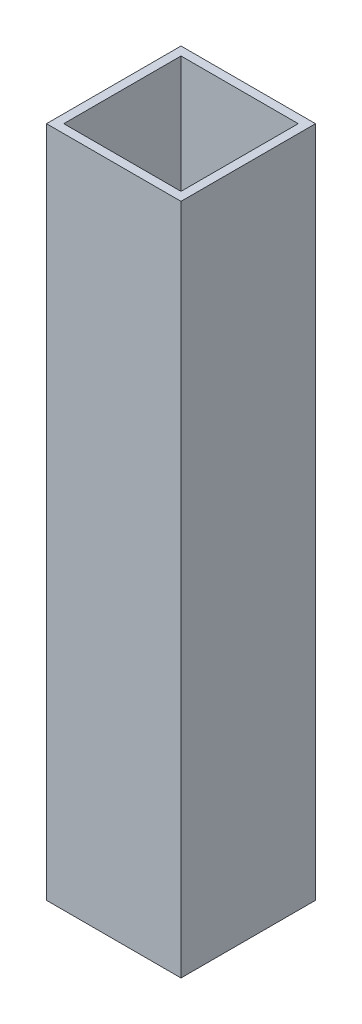
ISO-10303-21;
HEADER;
FILE_DESCRIPTION(('STEP AP214'),'2;1');
FILE_NAME('part.step','',(''),(''),'','','');
FILE_SCHEMA(('AUTOMOTIVE_DESIGN { 1 0 10303 214 1 1 1 1 }'));
ENDSEC;
DATA;
#1=APPLICATION_CONTEXT('core data for automotive mechanical design processes');
#2=APPLICATION_PROTOCOL_DEFINITION('international standard','automotive_design',2000,#1);
#3=PRODUCT_CONTEXT('',#1,'mechanical');
#4=PRODUCT('Part','Part','',(#3));
#5=PRODUCT_RELATED_PRODUCT_CATEGORY('part','',(#4));
#6=PRODUCT_DEFINITION_FORMATION('','',#4);
#7=PRODUCT_DEFINITION_CONTEXT('part definition',#1,'design');
#8=PRODUCT_DEFINITION('design','',#6,#7);
#9=PRODUCT_DEFINITION_SHAPE('','',#8);
#10=(LENGTH_UNIT() NAMED_UNIT(*) SI_UNIT(.MILLI.,.METRE.));
#11=(NAMED_UNIT(*) PLANE_ANGLE_UNIT() SI_UNIT($,.RADIAN.));
#12=(NAMED_UNIT(*) SI_UNIT($,.STERADIAN.) SOLID_ANGLE_UNIT());
#13=UNCERTAINTY_MEASURE_WITH_UNIT(LENGTH_MEASURE(1.E-05),#10,'distance_accuracy_value','');
#14=(GEOMETRIC_REPRESENTATION_CONTEXT(3) GLOBAL_UNCERTAINTY_ASSIGNED_CONTEXT((#13)) GLOBAL_UNIT_ASSIGNED_CONTEXT((#10,
#11,#12)) REPRESENTATION_CONTEXT('',''));
#15=CARTESIAN_POINT('',(0.,0.,0.));
#16=DIRECTION('',(0.,0.,1.));
#17=DIRECTION('',(1.,0.,0.));
#18=AXIS2_PLACEMENT_3D('',#15,#16,#17);
#19=CARTESIAN_POINT('',(0.,100.,0.));
#20=DIRECTION('',(0.,1.,0.));
#21=DIRECTION('',(0.,0.,1.));
#22=AXIS2_PLACEMENT_3D('',#19,#20,#21);
#23=PLANE('',#22);
#24=DIRECTION('',(0.,0.,-1.));
#25=VECTOR('',#24,1.);
#26=CARTESIAN_POINT('',(10.,100.,-10.));
#27=LINE('',#26,#25);
#28=CARTESIAN_POINT('',(10.,100.,10.));
#29=VERTEX_POINT('',#28);
#30=CARTESIAN_POINT('',(10.,100.,-10.));
#31=VERTEX_POINT('',#30);
#32=EDGE_CURVE('E155',#29,#31,#27,.T.);
#33=ORIENTED_EDGE('',*,*,#32,.T.);
#34=DIRECTION('',(-1.,0.,0.));
#35=VECTOR('',#34,1.);
#36=CARTESIAN_POINT('',(-10.,100.,-10.));
#37=LINE('',#36,#35);
#38=CARTESIAN_POINT('',(-10.,100.,-10.));
#39=VERTEX_POINT('',#38);
#40=EDGE_CURVE('E159',#31,#39,#37,.T.);
#41=ORIENTED_EDGE('',*,*,#40,.T.);
#42=DIRECTION('',(0.,0.,1.));
#43=VECTOR('',#42,1.);
#44=CARTESIAN_POINT('',(-10.,100.,-10.));
#45=LINE('',#44,#43);
#46=CARTESIAN_POINT('',(-10.,100.,10.));
#47=VERTEX_POINT('',#46);
#48=EDGE_CURVE('E163',#39,#47,#45,.T.);
#49=ORIENTED_EDGE('',*,*,#48,.T.);
#50=DIRECTION('',(1.,0.,0.));
#51=VECTOR('',#50,1.);
#52=CARTESIAN_POINT('',(-10.,100.,10.));
#53=LINE('',#52,#51);
#54=EDGE_CURVE('E166',#47,#29,#53,.T.);
#55=ORIENTED_EDGE('',*,*,#54,.T.);
#56=EDGE_LOOP('',(#33,#41,#49,#55));
#57=FACE_BOUND('',#56,.T.);
#58=DIRECTION('',(-1.,0.,0.));
#59=VECTOR('',#58,1.);
#60=CARTESIAN_POINT('',(-8.71583732425239,100.,-8.71583732425238));
#61=LINE('',#60,#59);
#62=CARTESIAN_POINT('',(8.71583732425237,100.,-8.71583732425238));
#63=VERTEX_POINT('',#62);
#64=CARTESIAN_POINT('',(-8.71583732425239,100.,-8.71583732425238));
#65=VERTEX_POINT('',#64);
#66=EDGE_CURVE('E116',#63,#65,#61,.T.);
#67=ORIENTED_EDGE('',*,*,#66,.F.);
#68=DIRECTION('',(0.,0.,-1.));
#69=VECTOR('',#68,1.);
#70=CARTESIAN_POINT('',(8.71583732425237,100.,-8.71583732425238));
#71=LINE('',#70,#69);
#72=CARTESIAN_POINT('',(8.71583732425238,100.,8.71583732425238));
#73=VERTEX_POINT('',#72);
#74=EDGE_CURVE('E107',#73,#63,#71,.T.);
#75=ORIENTED_EDGE('',*,*,#74,.F.);
#76=DIRECTION('',(1.,0.,0.));
#77=VECTOR('',#76,1.);
#78=CARTESIAN_POINT('',(-8.71583732425239,100.,8.71583732425238));
#79=LINE('',#78,#77);
#80=CARTESIAN_POINT('',(-8.71583732425239,100.,8.71583732425238));
#81=VERTEX_POINT('',#80);
#82=EDGE_CURVE('E133',#81,#73,#79,.T.);
#83=ORIENTED_EDGE('',*,*,#82,.F.);
#84=DIRECTION('',(0.,0.,1.));
#85=VECTOR('',#84,1.);
#86=CARTESIAN_POINT('',(-8.71583732425239,100.,-8.71583732425238));
#87=LINE('',#86,#85);
#88=EDGE_CURVE('E129',#65,#81,#87,.T.);
#89=ORIENTED_EDGE('',*,*,#88,.F.);
#90=EDGE_LOOP('',(#67,#75,#83,#89));
#91=FACE_BOUND('',#90,.T.);
#92=ADVANCED_FACE('F41',(#57,#91),#23,.T.);
#93=CARTESIAN_POINT('',(0.,0.,0.));
#94=DIRECTION('',(0.,1.,0.));
#95=DIRECTION('',(0.,0.,1.));
#96=AXIS2_PLACEMENT_3D('',#93,#94,#95);
#97=PLANE('',#96);
#98=DIRECTION('',(0.,0.,-1.));
#99=VECTOR('',#98,1.);
#100=CARTESIAN_POINT('',(10.,0.,-10.));
#101=LINE('',#100,#99);
#102=CARTESIAN_POINT('',(10.,0.,10.));
#103=VERTEX_POINT('',#102);
#104=CARTESIAN_POINT('',(10.,0.,-10.));
#105=VERTEX_POINT('',#104);
#106=EDGE_CURVE('E125',#103,#105,#101,.T.);
#107=ORIENTED_EDGE('',*,*,#106,.F.);
#108=DIRECTION('',(1.,0.,0.));
#109=VECTOR('',#108,1.);
#110=CARTESIAN_POINT('',(-10.,0.,10.));
#111=LINE('',#110,#109);
#112=CARTESIAN_POINT('',(-10.,0.,10.));
#113=VERTEX_POINT('',#112);
#114=EDGE_CURVE('E160',#113,#103,#111,.T.);
#115=ORIENTED_EDGE('',*,*,#114,.F.);
#116=DIRECTION('',(0.,0.,1.));
#117=VECTOR('',#116,1.);
#118=CARTESIAN_POINT('',(-10.,0.,-10.));
#119=LINE('',#118,#117);
#120=CARTESIAN_POINT('',(-10.,0.,-10.));
#121=VERTEX_POINT('',#120);
#122=EDGE_CURVE('E176',#121,#113,#119,.T.);
#123=ORIENTED_EDGE('',*,*,#122,.F.);
#124=DIRECTION('',(-1.,0.,0.));
#125=VECTOR('',#124,1.);
#126=CARTESIAN_POINT('',(-10.,0.,-10.));
#127=LINE('',#126,#125);
#128=EDGE_CURVE('E173',#105,#121,#127,.T.);
#129=ORIENTED_EDGE('',*,*,#128,.F.);
#130=EDGE_LOOP('',(#107,#115,#123,#129));
#131=FACE_BOUND('',#130,.T.);
#132=DIRECTION('',(0.,0.,-1.));
#133=VECTOR('',#132,1.);
#134=CARTESIAN_POINT('',(8.71583732425237,0.,-8.71583732425238));
#135=LINE('',#134,#133);
#136=CARTESIAN_POINT('',(8.71583732425238,0.,8.71583732425238));
#137=VERTEX_POINT('',#136);
#138=CARTESIAN_POINT('',(8.71583732425237,0.,-8.71583732425238));
#139=VERTEX_POINT('',#138);
#140=EDGE_CURVE('E65',#137,#139,#135,.T.);
#141=ORIENTED_EDGE('',*,*,#140,.T.);
#142=DIRECTION('',(-1.,0.,0.));
#143=VECTOR('',#142,1.);
#144=CARTESIAN_POINT('',(-8.71583732425239,0.,-8.71583732425238));
#145=LINE('',#144,#143);
#146=CARTESIAN_POINT('',(-8.71583732425239,0.,-8.71583732425238));
#147=VERTEX_POINT('',#146);
#148=EDGE_CURVE('E123',#139,#147,#145,.T.);
#149=ORIENTED_EDGE('',*,*,#148,.T.);
#150=DIRECTION('',(0.,0.,1.));
#151=VECTOR('',#150,1.);
#152=CARTESIAN_POINT('',(-8.71583732425239,0.,-8.71583732425238));
#153=LINE('',#152,#151);
#154=CARTESIAN_POINT('',(-8.71583732425239,0.,8.71583732425238));
#155=VERTEX_POINT('',#154);
#156=EDGE_CURVE('E142',#147,#155,#153,.T.);
#157=ORIENTED_EDGE('',*,*,#156,.T.);
#158=DIRECTION('',(1.,0.,0.));
#159=VECTOR('',#158,1.);
#160=CARTESIAN_POINT('',(-8.71583732425239,0.,8.71583732425238));
#161=LINE('',#160,#159);
#162=EDGE_CURVE('E117',#155,#137,#161,.T.);
#163=ORIENTED_EDGE('',*,*,#162,.T.);
#164=EDGE_LOOP('',(#141,#149,#157,#163));
#165=FACE_BOUND('',#164,.T.);
#166=ADVANCED_FACE('F199',(#131,#165),#97,.F.);
#167=CARTESIAN_POINT('',(10.,100.,-10.));
#168=DIRECTION('',(-1.,0.,0.));
#169=DIRECTION('',(0.,0.,1.));
#170=AXIS2_PLACEMENT_3D('',#167,#168,#169);
#171=PLANE('',#170);
#172=ORIENTED_EDGE('',*,*,#106,.T.);
#173=DIRECTION('',(0.,-1.,0.));
#174=VECTOR('',#173,1.);
#175=CARTESIAN_POINT('',(10.,100.,-10.));
#176=LINE('',#175,#174);
#177=EDGE_CURVE('E11',#31,#105,#176,.T.);
#178=ORIENTED_EDGE('',*,*,#177,.F.);
#179=ORIENTED_EDGE('',*,*,#32,.F.);
#180=DIRECTION('',(0.,-1.,0.));
#181=VECTOR('',#180,1.);
#182=CARTESIAN_POINT('',(10.,100.,10.));
#183=LINE('',#182,#181);
#184=EDGE_CURVE('E169',#29,#103,#183,.T.);
#185=ORIENTED_EDGE('',*,*,#184,.T.);
#186=EDGE_LOOP('',(#172,#178,#179,#185));
#187=FACE_BOUND('',#186,.T.);
#188=ADVANCED_FACE('F43',(#187),#171,.F.);
#189=CARTESIAN_POINT('',(-10.,100.,-10.));
#190=DIRECTION('',(0.,0.,1.));
#191=DIRECTION('',(1.,0.,0.));
#192=AXIS2_PLACEMENT_3D('',#189,#190,#191);
#193=PLANE('',#192);
#194=ORIENTED_EDGE('',*,*,#128,.T.);
#195=DIRECTION('',(0.,-1.,0.));
#196=VECTOR('',#195,1.);
#197=CARTESIAN_POINT('',(-10.,100.,-10.));
#198=LINE('',#197,#196);
#199=EDGE_CURVE('E50',#39,#121,#198,.T.);
#200=ORIENTED_EDGE('',*,*,#199,.F.);
#201=ORIENTED_EDGE('',*,*,#40,.F.);
#202=ORIENTED_EDGE('',*,*,#177,.T.);
#203=EDGE_LOOP('',(#194,#200,#201,#202));
#204=FACE_BOUND('',#203,.T.);
#205=ADVANCED_FACE('F209',(#204),#193,.F.);
#206=CARTESIAN_POINT('',(-10.,100.,-10.));
#207=DIRECTION('',(1.,0.,0.));
#208=DIRECTION('',(0.,0.,-1.));
#209=AXIS2_PLACEMENT_3D('',#206,#207,#208);
#210=PLANE('',#209);
#211=ORIENTED_EDGE('',*,*,#122,.T.);
#212=DIRECTION('',(0.,-1.,0.));
#213=VECTOR('',#212,1.);
#214=CARTESIAN_POINT('',(-10.,100.,10.));
#215=LINE('',#214,#213);
#216=EDGE_CURVE('E184',#47,#113,#215,.T.);
#217=ORIENTED_EDGE('',*,*,#216,.F.);
#218=ORIENTED_EDGE('',*,*,#48,.F.);
#219=ORIENTED_EDGE('',*,*,#199,.T.);
#220=EDGE_LOOP('',(#211,#217,#218,#219));
#221=FACE_BOUND('',#220,.T.);
#222=ADVANCED_FACE('F193',(#221),#210,.F.);
#223=CARTESIAN_POINT('',(-10.,100.,10.));
#224=DIRECTION('',(0.,0.,-1.));
#225=DIRECTION('',(-1.,0.,0.));
#226=AXIS2_PLACEMENT_3D('',#223,#224,#225);
#227=PLANE('',#226);
#228=ORIENTED_EDGE('',*,*,#114,.T.);
#229=ORIENTED_EDGE('',*,*,#184,.F.);
#230=ORIENTED_EDGE('',*,*,#54,.F.);
#231=ORIENTED_EDGE('',*,*,#216,.T.);
#232=EDGE_LOOP('',(#228,#229,#230,#231));
#233=FACE_BOUND('',#232,.T.);
#234=ADVANCED_FACE('F203',(#233),#227,.F.);
#235=CARTESIAN_POINT('',(8.71583732425237,100.,-8.71583732425238));
#236=DIRECTION('',(-1.,0.,0.));
#237=DIRECTION('',(0.,0.,1.));
#238=AXIS2_PLACEMENT_3D('',#235,#236,#237);
#239=PLANE('',#238);
#240=ORIENTED_EDGE('',*,*,#140,.F.);
#241=DIRECTION('',(0.,-1.,0.));
#242=VECTOR('',#241,1.);
#243=CARTESIAN_POINT('',(8.71583732425238,100.,8.71583732425238));
#244=LINE('',#243,#242);
#245=EDGE_CURVE('E111',#73,#137,#244,.T.);
#246=ORIENTED_EDGE('',*,*,#245,.F.);
#247=ORIENTED_EDGE('',*,*,#74,.T.);
#248=DIRECTION('',(0.,-1.,0.));
#249=VECTOR('',#248,1.);
#250=CARTESIAN_POINT('',(8.71583732425237,100.,-8.71583732425238));
#251=LINE('',#250,#249);
#252=EDGE_CURVE('E110',#63,#139,#251,.T.);
#253=ORIENTED_EDGE('',*,*,#252,.T.);
#254=EDGE_LOOP('',(#240,#246,#247,#253));
#255=FACE_BOUND('',#254,.T.);
#256=ADVANCED_FACE('F109',(#255),#239,.T.);
#257=CARTESIAN_POINT('',(-8.71583732425239,100.,-8.71583732425238));
#258=DIRECTION('',(0.,0.,1.));
#259=DIRECTION('',(1.,0.,0.));
#260=AXIS2_PLACEMENT_3D('',#257,#258,#259);
#261=PLANE('',#260);
#262=ORIENTED_EDGE('',*,*,#148,.F.);
#263=ORIENTED_EDGE('',*,*,#252,.F.);
#264=ORIENTED_EDGE('',*,*,#66,.T.);
#265=DIRECTION('',(0.,-1.,0.));
#266=VECTOR('',#265,1.);
#267=CARTESIAN_POINT('',(-8.71583732425239,100.,-8.71583732425238));
#268=LINE('',#267,#266);
#269=EDGE_CURVE('E126',#65,#147,#268,.T.);
#270=ORIENTED_EDGE('',*,*,#269,.T.);
#271=EDGE_LOOP('',(#262,#263,#264,#270));
#272=FACE_BOUND('',#271,.T.);
#273=ADVANCED_FACE('F120',(#272),#261,.T.);
#274=CARTESIAN_POINT('',(-8.71583732425239,100.,-8.71583732425238));
#275=DIRECTION('',(1.,0.,0.));
#276=DIRECTION('',(0.,0.,-1.));
#277=AXIS2_PLACEMENT_3D('',#274,#275,#276);
#278=PLANE('',#277);
#279=ORIENTED_EDGE('',*,*,#156,.F.);
#280=ORIENTED_EDGE('',*,*,#269,.F.);
#281=ORIENTED_EDGE('',*,*,#88,.T.);
#282=DIRECTION('',(0.,-1.,0.));
#283=VECTOR('',#282,1.);
#284=CARTESIAN_POINT('',(-8.71583732425239,100.,8.71583732425238));
#285=LINE('',#284,#283);
#286=EDGE_CURVE('E57',#81,#155,#285,.T.);
#287=ORIENTED_EDGE('',*,*,#286,.T.);
#288=EDGE_LOOP('',(#279,#280,#281,#287));
#289=FACE_BOUND('',#288,.T.);
#290=ADVANCED_FACE('F232',(#289),#278,.T.);
#291=CARTESIAN_POINT('',(-8.71583732425239,100.,8.71583732425238));
#292=DIRECTION('',(0.,0.,-1.));
#293=DIRECTION('',(-1.,0.,0.));
#294=AXIS2_PLACEMENT_3D('',#291,#292,#293);
#295=PLANE('',#294);
#296=ORIENTED_EDGE('',*,*,#162,.F.);
#297=ORIENTED_EDGE('',*,*,#286,.F.);
#298=ORIENTED_EDGE('',*,*,#82,.T.);
#299=ORIENTED_EDGE('',*,*,#245,.T.);
#300=EDGE_LOOP('',(#296,#297,#298,#299));
#301=FACE_BOUND('',#300,.T.);
#302=ADVANCED_FACE('F236',(#301),#295,.T.);
#303=CLOSED_SHELL('',(#92,#166,#188,#205,#222,#234,#256,#273,#290,#302));
#304=MANIFOLD_SOLID_BREP('B2',#303);
#305=ADVANCED_BREP_SHAPE_REPRESENTATION('',(#18,#304),#14);
#306=SHAPE_DEFINITION_REPRESENTATION(#9,#305);
ENDSEC;
END-ISO-10303-21;
